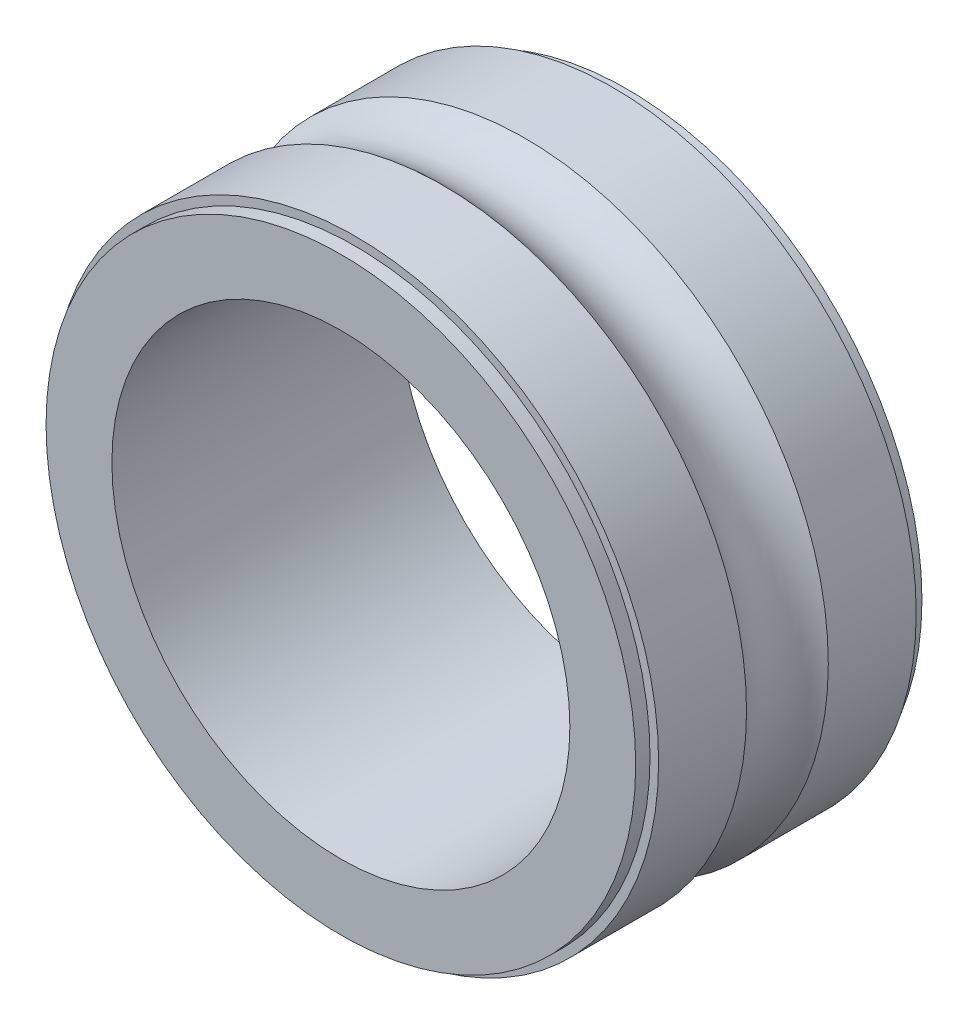
ISO-10303-21;
HEADER;
FILE_DESCRIPTION(('STEP AP214'),'2;1');
FILE_NAME('part.step','',(''),(''),'','','');
FILE_SCHEMA(('AUTOMOTIVE_DESIGN { 1 0 10303 214 1 1 1 1 }'));
ENDSEC;
DATA;
#1=APPLICATION_CONTEXT('core data for automotive mechanical design processes');
#2=APPLICATION_PROTOCOL_DEFINITION('international standard','automotive_design',2000,#1);
#3=PRODUCT_CONTEXT('',#1,'mechanical');
#4=PRODUCT('Part','Part','',(#3));
#5=PRODUCT_RELATED_PRODUCT_CATEGORY('part','',(#4));
#6=PRODUCT_DEFINITION_FORMATION('','',#4);
#7=PRODUCT_DEFINITION_CONTEXT('part definition',#1,'design');
#8=PRODUCT_DEFINITION('design','',#6,#7);
#9=PRODUCT_DEFINITION_SHAPE('','',#8);
#10=(LENGTH_UNIT() NAMED_UNIT(*) SI_UNIT(.MILLI.,.METRE.));
#11=(NAMED_UNIT(*) PLANE_ANGLE_UNIT() SI_UNIT($,.RADIAN.));
#12=(NAMED_UNIT(*) SI_UNIT($,.STERADIAN.) SOLID_ANGLE_UNIT());
#13=UNCERTAINTY_MEASURE_WITH_UNIT(LENGTH_MEASURE(1.E-05),#10,'distance_accuracy_value','');
#14=(GEOMETRIC_REPRESENTATION_CONTEXT(3) GLOBAL_UNCERTAINTY_ASSIGNED_CONTEXT((#13)) GLOBAL_UNIT_ASSIGNED_CONTEXT((#10,
#11,#12)) REPRESENTATION_CONTEXT('',''));
#15=CARTESIAN_POINT('',(0.,0.,0.));
#16=DIRECTION('',(0.,0.,1.));
#17=DIRECTION('',(1.,0.,0.));
#18=AXIS2_PLACEMENT_3D('',#15,#16,#17);
#19=CARTESIAN_POINT('',(0.,0.,6.75539907110854));
#20=DIRECTION('',(0.,0.,1.));
#21=DIRECTION('',(1.,0.,0.));
#22=AXIS2_PLACEMENT_3D('',#19,#20,#21);
#23=CYLINDRICAL_SURFACE('',#22,4.);
#24=CARTESIAN_POINT('',(0.,0.,-2.5));
#25=DIRECTION('',(0.,0.,1.));
#26=DIRECTION('',(1.,0.,0.));
#27=AXIS2_PLACEMENT_3D('',#24,#25,#26);
#28=CIRCLE('',#27,4.);
#29=CARTESIAN_POINT('',(4.,0.,-2.5));
#30=VERTEX_POINT('',#29);
#31=EDGE_CURVE('E10',#30,#30,#28,.T.);
#32=ORIENTED_EDGE('',*,*,#31,.F.);
#33=EDGE_LOOP('',(#32));
#34=FACE_BOUND('',#33,.T.);
#35=CARTESIAN_POINT('',(0.,0.,2.5));
#36=DIRECTION('',(0.,0.,1.));
#37=DIRECTION('',(1.,0.,0.));
#38=AXIS2_PLACEMENT_3D('',#35,#36,#37);
#39=CIRCLE('',#38,4.);
#40=CARTESIAN_POINT('',(4.,0.,2.5));
#41=VERTEX_POINT('',#40);
#42=EDGE_CURVE('E68',#41,#41,#39,.T.);
#43=ORIENTED_EDGE('',*,*,#42,.T.);
#44=EDGE_LOOP('',(#43));
#45=FACE_BOUND('',#44,.T.);
#46=ADVANCED_FACE('F34',(#34,#45),#23,.F.);
#47=CARTESIAN_POINT('',(0.,5.15,-2.5));
#48=DIRECTION('',(0.,0.,1.));
#49=DIRECTION('',(1.,0.,0.));
#50=AXIS2_PLACEMENT_3D('',#47,#48,#49);
#51=PLANE('',#50);
#52=CARTESIAN_POINT('',(0.,0.,-2.5));
#53=DIRECTION('',(0.,0.,1.));
#54=DIRECTION('',(1.,0.,0.));
#55=AXIS2_PLACEMENT_3D('',#52,#53,#54);
#56=CIRCLE('',#55,5.15);
#57=CARTESIAN_POINT('',(5.15,0.,-2.5));
#58=VERTEX_POINT('',#57);
#59=EDGE_CURVE('E40',#58,#58,#56,.T.);
#60=ORIENTED_EDGE('',*,*,#59,.F.);
#61=EDGE_LOOP('',(#60));
#62=FACE_BOUND('',#61,.T.);
#63=ORIENTED_EDGE('',*,*,#31,.T.);
#64=EDGE_LOOP('',(#63));
#65=FACE_BOUND('',#64,.T.);
#66=ADVANCED_FACE('F117',(#62,#65),#51,.F.);
#67=CARTESIAN_POINT('',(0.,0.,6.75539907110854));
#68=DIRECTION('',(0.,0.,1.));
#69=DIRECTION('',(1.,0.,0.));
#70=AXIS2_PLACEMENT_3D('',#67,#68,#69);
#71=CYLINDRICAL_SURFACE('',#70,5.15);
#72=CARTESIAN_POINT('',(0.,0.,-2.25000000000001));
#73=DIRECTION('',(0.,0.,1.));
#74=DIRECTION('',(1.,0.,0.));
#75=AXIS2_PLACEMENT_3D('',#72,#73,#74);
#76=CIRCLE('',#75,5.15);
#77=CARTESIAN_POINT('',(5.15,0.,-2.25000000000001));
#78=VERTEX_POINT('',#77);
#79=EDGE_CURVE('E44',#78,#78,#76,.T.);
#80=ORIENTED_EDGE('',*,*,#79,.F.);
#81=EDGE_LOOP('',(#80));
#82=FACE_BOUND('',#81,.T.);
#83=ORIENTED_EDGE('',*,*,#59,.T.);
#84=EDGE_LOOP('',(#83));
#85=FACE_BOUND('',#84,.T.);
#86=ADVANCED_FACE('F112',(#82,#85),#71,.T.);
#87=CARTESIAN_POINT('',(0.,5.3,-2.25000000000001));
#88=DIRECTION('',(0.,0.,1.));
#89=DIRECTION('',(1.,0.,0.));
#90=AXIS2_PLACEMENT_3D('',#87,#88,#89);
#91=PLANE('',#90);
#92=CARTESIAN_POINT('',(0.,0.,-2.25000000000001));
#93=DIRECTION('',(0.,0.,1.));
#94=DIRECTION('',(1.,0.,0.));
#95=AXIS2_PLACEMENT_3D('',#92,#93,#94);
#96=CIRCLE('',#95,5.3);
#97=CARTESIAN_POINT('',(5.3,0.,-2.25000000000001));
#98=VERTEX_POINT('',#97);
#99=EDGE_CURVE('E48',#98,#98,#96,.T.);
#100=ORIENTED_EDGE('',*,*,#99,.F.);
#101=EDGE_LOOP('',(#100));
#102=FACE_BOUND('',#101,.T.);
#103=ORIENTED_EDGE('',*,*,#79,.T.);
#104=EDGE_LOOP('',(#103));
#105=FACE_BOUND('',#104,.T.);
#106=ADVANCED_FACE('F106',(#102,#105),#91,.F.);
#107=CARTESIAN_POINT('',(0.,0.,6.75539907110854));
#108=DIRECTION('',(0.,0.,1.));
#109=DIRECTION('',(1.,0.,0.));
#110=AXIS2_PLACEMENT_3D('',#107,#108,#109);
#111=CYLINDRICAL_SURFACE('',#110,5.3);
#112=CARTESIAN_POINT('',(0.,0.,-0.714142842854286));
#113=DIRECTION('',(0.,0.,1.));
#114=DIRECTION('',(1.,0.,0.));
#115=AXIS2_PLACEMENT_3D('',#112,#113,#114);
#116=CIRCLE('',#115,5.3);
#117=CARTESIAN_POINT('',(5.3,0.,-0.714142842854286));
#118=VERTEX_POINT('',#117);
#119=EDGE_CURVE('E53',#118,#118,#116,.T.);
#120=ORIENTED_EDGE('',*,*,#119,.F.);
#121=EDGE_LOOP('',(#120));
#122=FACE_BOUND('',#121,.T.);
#123=ORIENTED_EDGE('',*,*,#99,.T.);
#124=EDGE_LOOP('',(#123));
#125=FACE_BOUND('',#124,.T.);
#126=ADVANCED_FACE('F100',(#122,#125),#111,.T.);
#127=CARTESIAN_POINT('',(0.,0.,0.));
#128=DIRECTION('',(0.,0.,1.));
#129=DIRECTION('',(1.,0.,0.));
#130=AXIS2_PLACEMENT_3D('',#127,#128,#129);
#131=TOROIDAL_SURFACE('',#130,6.,1.);
#132=CARTESIAN_POINT('',(0.,0.,0.714142842854288));
#133=DIRECTION('',(0.,0.,1.));
#134=DIRECTION('',(1.,0.,0.));
#135=AXIS2_PLACEMENT_3D('',#132,#133,#134);
#136=CIRCLE('',#135,5.3);
#137=CARTESIAN_POINT('',(5.3,0.,0.714142842854288));
#138=VERTEX_POINT('',#137);
#139=EDGE_CURVE('E56',#138,#138,#136,.T.);
#140=ORIENTED_EDGE('',*,*,#139,.F.);
#141=EDGE_LOOP('',(#140));
#142=FACE_BOUND('',#141,.T.);
#143=ORIENTED_EDGE('',*,*,#119,.T.);
#144=EDGE_LOOP('',(#143));
#145=FACE_BOUND('',#144,.T.);
#146=ADVANCED_FACE('F94',(#142,#145),#131,.F.);
#147=CARTESIAN_POINT('',(0.,0.,6.75539907110854));
#148=DIRECTION('',(0.,0.,1.));
#149=DIRECTION('',(1.,0.,0.));
#150=AXIS2_PLACEMENT_3D('',#147,#148,#149);
#151=CYLINDRICAL_SURFACE('',#150,5.3);
#152=CARTESIAN_POINT('',(0.,0.,2.25000000000001));
#153=DIRECTION('',(0.,0.,1.));
#154=DIRECTION('',(1.,0.,0.));
#155=AXIS2_PLACEMENT_3D('',#152,#153,#154);
#156=CIRCLE('',#155,5.3);
#157=CARTESIAN_POINT('',(5.3,0.,2.25000000000001));
#158=VERTEX_POINT('',#157);
#159=EDGE_CURVE('E59',#158,#158,#156,.T.);
#160=ORIENTED_EDGE('',*,*,#159,.F.);
#161=EDGE_LOOP('',(#160));
#162=FACE_BOUND('',#161,.T.);
#163=ORIENTED_EDGE('',*,*,#139,.T.);
#164=EDGE_LOOP('',(#163));
#165=FACE_BOUND('',#164,.T.);
#166=ADVANCED_FACE('F88',(#162,#165),#151,.T.);
#167=CARTESIAN_POINT('',(0.,5.3,2.25000000000001));
#168=DIRECTION('',(0.,0.,-1.));
#169=DIRECTION('',(-1.,0.,0.));
#170=AXIS2_PLACEMENT_3D('',#167,#168,#169);
#171=PLANE('',#170);
#172=CARTESIAN_POINT('',(0.,0.,2.25000000000001));
#173=DIRECTION('',(0.,0.,1.));
#174=DIRECTION('',(1.,0.,0.));
#175=AXIS2_PLACEMENT_3D('',#172,#173,#174);
#176=CIRCLE('',#175,5.15);
#177=CARTESIAN_POINT('',(5.15,0.,2.25000000000001));
#178=VERTEX_POINT('',#177);
#179=EDGE_CURVE('E62',#178,#178,#176,.T.);
#180=ORIENTED_EDGE('',*,*,#179,.F.);
#181=EDGE_LOOP('',(#180));
#182=FACE_BOUND('',#181,.T.);
#183=ORIENTED_EDGE('',*,*,#159,.T.);
#184=EDGE_LOOP('',(#183));
#185=FACE_BOUND('',#184,.T.);
#186=ADVANCED_FACE('F82',(#182,#185),#171,.F.);
#187=CARTESIAN_POINT('',(0.,0.,6.75539907110854));
#188=DIRECTION('',(0.,0.,1.));
#189=DIRECTION('',(1.,0.,0.));
#190=AXIS2_PLACEMENT_3D('',#187,#188,#189);
#191=CYLINDRICAL_SURFACE('',#190,5.15);
#192=CARTESIAN_POINT('',(0.,0.,2.5));
#193=DIRECTION('',(0.,0.,1.));
#194=DIRECTION('',(1.,0.,0.));
#195=AXIS2_PLACEMENT_3D('',#192,#193,#194);
#196=CIRCLE('',#195,5.15);
#197=CARTESIAN_POINT('',(5.15,0.,2.5));
#198=VERTEX_POINT('',#197);
#199=EDGE_CURVE('E65',#198,#198,#196,.T.);
#200=ORIENTED_EDGE('',*,*,#199,.F.);
#201=EDGE_LOOP('',(#200));
#202=FACE_BOUND('',#201,.T.);
#203=ORIENTED_EDGE('',*,*,#179,.T.);
#204=EDGE_LOOP('',(#203));
#205=FACE_BOUND('',#204,.T.);
#206=ADVANCED_FACE('F76',(#202,#205),#191,.T.);
#207=CARTESIAN_POINT('',(0.,5.15,2.5));
#208=DIRECTION('',(0.,0.,-1.));
#209=DIRECTION('',(-1.,0.,0.));
#210=AXIS2_PLACEMENT_3D('',#207,#208,#209);
#211=PLANE('',#210);
#212=ORIENTED_EDGE('',*,*,#42,.F.);
#213=EDGE_LOOP('',(#212));
#214=FACE_BOUND('',#213,.T.);
#215=ORIENTED_EDGE('',*,*,#199,.T.);
#216=EDGE_LOOP('',(#215));
#217=FACE_BOUND('',#216,.T.);
#218=ADVANCED_FACE('F73',(#214,#217),#211,.F.);
#219=CLOSED_SHELL('',(#46,#66,#86,#106,#126,#146,#166,#186,#206,#218));
#220=MANIFOLD_SOLID_BREP('B2',#219);
#221=ADVANCED_BREP_SHAPE_REPRESENTATION('',(#18,#220),#14);
#222=SHAPE_DEFINITION_REPRESENTATION(#9,#221);
ENDSEC;
END-ISO-10303-21;
